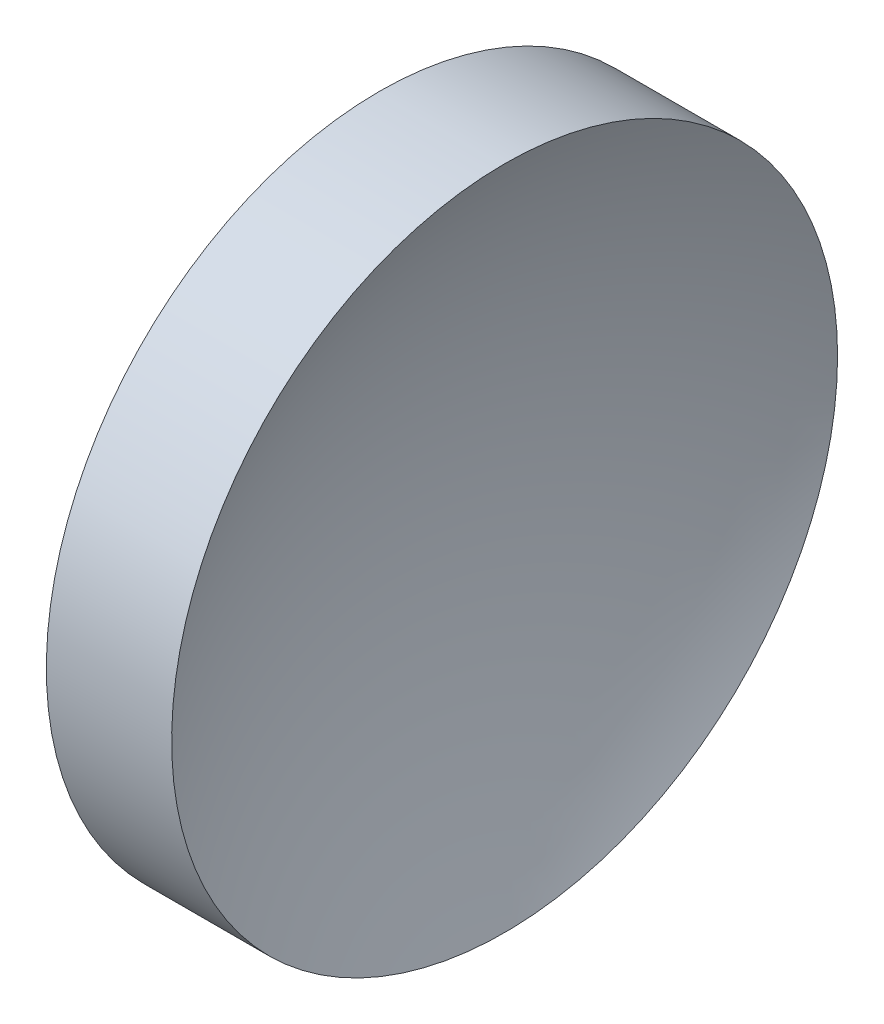
ISO-10303-21;
HEADER;
FILE_DESCRIPTION(('STEP AP214'),'2;1');
FILE_NAME('part.step','',(''),(''),'','','');
FILE_SCHEMA(('AUTOMOTIVE_DESIGN { 1 0 10303 214 1 1 1 1 }'));
ENDSEC;
DATA;
#1=APPLICATION_CONTEXT('core data for automotive mechanical design processes');
#2=APPLICATION_PROTOCOL_DEFINITION('international standard','automotive_design',2000,#1);
#3=PRODUCT_CONTEXT('',#1,'mechanical');
#4=PRODUCT('Part','Part','',(#3));
#5=PRODUCT_RELATED_PRODUCT_CATEGORY('part','',(#4));
#6=PRODUCT_DEFINITION_FORMATION('','',#4);
#7=PRODUCT_DEFINITION_CONTEXT('part definition',#1,'design');
#8=PRODUCT_DEFINITION('design','',#6,#7);
#9=PRODUCT_DEFINITION_SHAPE('','',#8);
#10=(LENGTH_UNIT() NAMED_UNIT(*) SI_UNIT(.MILLI.,.METRE.));
#11=(NAMED_UNIT(*) PLANE_ANGLE_UNIT() SI_UNIT($,.RADIAN.));
#12=(NAMED_UNIT(*) SI_UNIT($,.STERADIAN.) SOLID_ANGLE_UNIT());
#13=UNCERTAINTY_MEASURE_WITH_UNIT(LENGTH_MEASURE(1.E-05),#10,'distance_accuracy_value','');
#14=(GEOMETRIC_REPRESENTATION_CONTEXT(3) GLOBAL_UNCERTAINTY_ASSIGNED_CONTEXT((#13)) GLOBAL_UNIT_ASSIGNED_CONTEXT((#10,
#11,#12)) REPRESENTATION_CONTEXT('',''));
#15=CARTESIAN_POINT('',(0.,0.,0.));
#16=DIRECTION('',(0.,0.,1.));
#17=DIRECTION('',(1.,0.,0.));
#18=AXIS2_PLACEMENT_3D('',#15,#16,#17);
#19=CARTESIAN_POINT('',(-29.2544798442334,34.5168962409161,22.1552279145953));
#20=DIRECTION('',(1.,0.,0.));
#21=DIRECTION('',(0.,1.,0.));
#22=AXIS2_PLACEMENT_3D('',#19,#20,#21);
#23=SPHERICAL_SURFACE('',#22,55.3);
#24=CARTESIAN_POINT('',(-78.3760636949196,34.5168962409161,22.1552279145953));
#25=DIRECTION('',(1.,0.,0.));
#26=DIRECTION('',(0.,0.,-1.));
#27=AXIS2_PLACEMENT_3D('',#24,#25,#26);
#28=CIRCLE('',#27,25.4);
#29=CARTESIAN_POINT('',(-78.3760636949196,34.5168962409161,-3.24477208540466));
#30=VERTEX_POINT('',#29);
#31=EDGE_CURVE('E8',#30,#30,#28,.T.);
#32=ORIENTED_EDGE('',*,*,#31,.T.);
#33=EDGE_LOOP('',(#32));
#34=FACE_BOUND('',#33,.T.);
#35=ADVANCED_FACE('F13',(#34),#23,.F.);
#36=CARTESIAN_POINT('',(-84.5544798442333,34.5168962409161,22.1552279145953));
#37=DIRECTION('',(1.,0.,0.));
#38=DIRECTION('',(0.,0.,-1.));
#39=AXIS2_PLACEMENT_3D('',#36,#37,#38);
#40=CYLINDRICAL_SURFACE('',#39,25.4);
#41=CARTESIAN_POINT('',(-87.9350232450416,34.5168962409161,22.1552279145953));
#42=DIRECTION('',(1.,0.,0.));
#43=DIRECTION('',(0.,0.,-1.));
#44=AXIS2_PLACEMENT_3D('',#41,#42,#43);
#45=CIRCLE('',#44,25.4);
#46=CARTESIAN_POINT('',(-87.9350232450416,34.5168962409161,-3.24477208540469));
#47=VERTEX_POINT('',#46);
#48=EDGE_CURVE('E19',#47,#47,#45,.T.);
#49=ORIENTED_EDGE('',*,*,#48,.T.);
#50=EDGE_LOOP('',(#49));
#51=FACE_BOUND('',#50,.T.);
#52=ORIENTED_EDGE('',*,*,#31,.F.);
#53=EDGE_LOOP('',(#52));
#54=FACE_BOUND('',#53,.T.);
#55=ADVANCED_FACE('F25',(#51,#54),#40,.T.);
#56=CARTESIAN_POINT('',(110.445520155767,34.5168962409161,22.1552279145953));
#57=DIRECTION('',(1.,0.,0.));
#58=DIRECTION('',(0.,1.,0.));
#59=AXIS2_PLACEMENT_3D('',#56,#57,#58);
#60=SPHERICAL_SURFACE('',#59,200.);
#61=ORIENTED_EDGE('',*,*,#48,.F.);
#62=EDGE_LOOP('',(#61));
#63=FACE_BOUND('',#62,.T.);
#64=ADVANCED_FACE('F28',(#63),#60,.T.);
#65=CLOSED_SHELL('',(#35,#55,#64));
#66=MANIFOLD_SOLID_BREP('B1',#65);
#67=ADVANCED_BREP_SHAPE_REPRESENTATION('',(#18,#66),#14);
#68=SHAPE_DEFINITION_REPRESENTATION(#9,#67);
ENDSEC;
END-ISO-10303-21;
